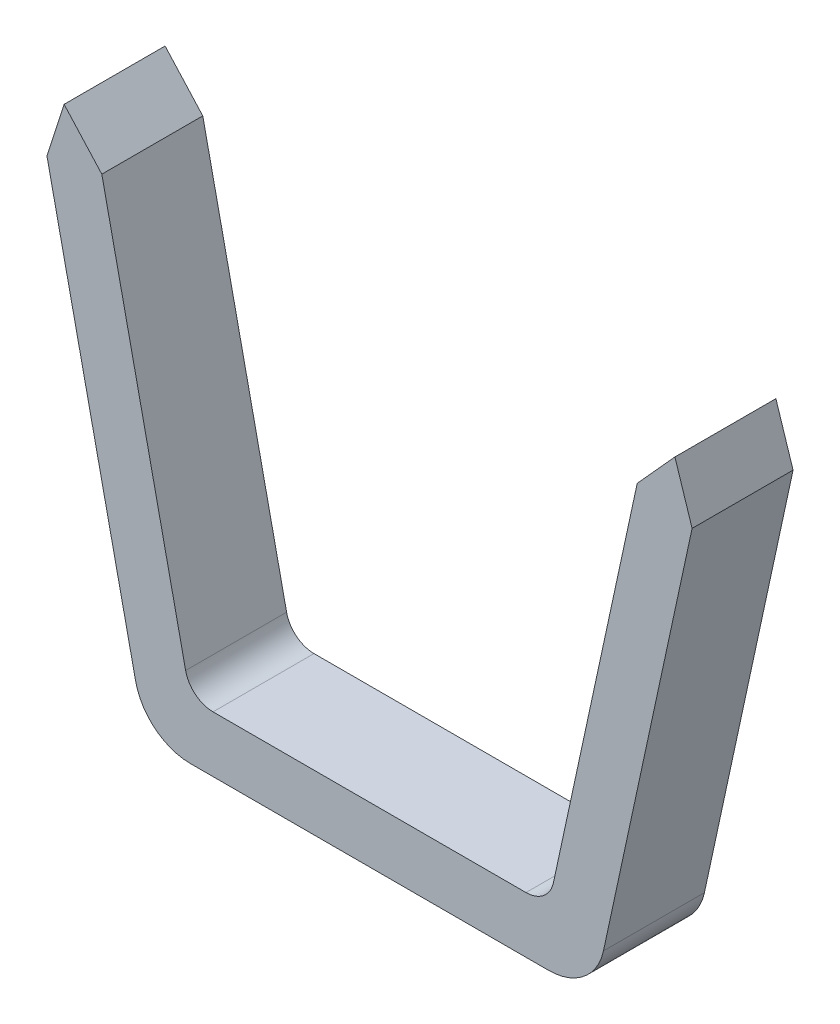
ISO-10303-21;
HEADER;
FILE_DESCRIPTION(('STEP AP214'),'2;1');
FILE_NAME('part.step','',(''),(''),'','','');
FILE_SCHEMA(('AUTOMOTIVE_DESIGN { 1 0 10303 214 1 1 1 1 }'));
ENDSEC;
DATA;
#1=APPLICATION_CONTEXT('core data for automotive mechanical design processes');
#2=APPLICATION_PROTOCOL_DEFINITION('international standard','automotive_design',2000,#1);
#3=PRODUCT_CONTEXT('',#1,'mechanical');
#4=PRODUCT('Part','Part','',(#3));
#5=PRODUCT_RELATED_PRODUCT_CATEGORY('part','',(#4));
#6=PRODUCT_DEFINITION_FORMATION('','',#4);
#7=PRODUCT_DEFINITION_CONTEXT('part definition',#1,'design');
#8=PRODUCT_DEFINITION('design','',#6,#7);
#9=PRODUCT_DEFINITION_SHAPE('','',#8);
#10=(LENGTH_UNIT() NAMED_UNIT(*) SI_UNIT(.MILLI.,.METRE.));
#11=(NAMED_UNIT(*) PLANE_ANGLE_UNIT() SI_UNIT($,.RADIAN.));
#12=(NAMED_UNIT(*) SI_UNIT($,.STERADIAN.) SOLID_ANGLE_UNIT());
#13=UNCERTAINTY_MEASURE_WITH_UNIT(LENGTH_MEASURE(1.E-05),#10,'distance_accuracy_value','');
#14=(GEOMETRIC_REPRESENTATION_CONTEXT(3) GLOBAL_UNCERTAINTY_ASSIGNED_CONTEXT((#13)) GLOBAL_UNIT_ASSIGNED_CONTEXT((#10,
#11,#12)) REPRESENTATION_CONTEXT('',''));
#15=CARTESIAN_POINT('',(0.,0.,0.));
#16=DIRECTION('',(0.,0.,1.));
#17=DIRECTION('',(1.,0.,0.));
#18=AXIS2_PLACEMENT_3D('',#15,#16,#17);
#19=CARTESIAN_POINT('',(-31.9298733487398,-112.5,18.));
#20=DIRECTION('',(0.,0.,1.));
#21=DIRECTION('',(1.,0.,0.));
#22=AXIS2_PLACEMENT_3D('',#19,#20,#21);
#23=PLANE('',#22);
#24=DIRECTION('',(0.306672532909785,-0.951815085801174,0.));
#25=VECTOR('',#24,1.);
#26=CARTESIAN_POINT('',(54.4443390688109,-31.9720104377862,18.));
#27=LINE('',#26,#25);
#28=CARTESIAN_POINT('',(54.4443390688109,-31.9720104377862,18.));
#29=VERTEX_POINT('',#28);
#30=CARTESIAN_POINT('',(57.5063561450649,-41.4755483598365,18.));
#31=VERTEX_POINT('',#30);
#32=EDGE_CURVE('E145',#29,#31,#27,.T.);
#33=ORIENTED_EDGE('',*,*,#32,.F.);
#34=DIRECTION('',(0.670959777554308,0.741493747043273,0.));
#35=VECTOR('',#34,1.);
#36=CARTESIAN_POINT('',(47.7244032118376,-39.3983727700264,18.));
#37=LINE('',#36,#35);
#38=CARTESIAN_POINT('',(47.7244032118376,-39.3983727700264,18.));
#39=VERTEX_POINT('',#38);
#40=EDGE_CURVE('E259',#39,#29,#37,.T.);
#41=ORIENTED_EDGE('',*,*,#40,.F.);
#42=DIRECTION('',(0.211189373172623,0.977445164016353,0.));
#43=VECTOR('',#42,1.);
#44=CARTESIAN_POINT('',(31.9298733487398,-112.5,18.));
#45=LINE('',#44,#43);
#46=CARTESIAN_POINT('',(32.7820358431914,-108.555946865863,18.));
#47=VERTEX_POINT('',#46);
#48=EDGE_CURVE('E219',#47,#39,#45,.T.);
#49=ORIENTED_EDGE('',*,*,#48,.F.);
#50=CARTESIAN_POINT('',(27.8948100231097,-107.5,18.));
#51=DIRECTION('',(0.,0.,1.));
#52=DIRECTION('',(1.,0.,0.));
#53=AXIS2_PLACEMENT_3D('',#50,#51,#52);
#54=CIRCLE('',#53,5.);
#55=CARTESIAN_POINT('',(27.8948100231097,-112.5,18.));
#56=VERTEX_POINT('',#55);
#57=EDGE_CURVE('E194',#47,#56,#54,.F.);
#58=ORIENTED_EDGE('',*,*,#57,.T.);
#59=DIRECTION('',(1.,0.,0.));
#60=VECTOR('',#59,1.);
#61=CARTESIAN_POINT('',(-31.9298733487398,-112.5,18.));
#62=LINE('',#61,#60);
#63=CARTESIAN_POINT('',(-27.8948100231097,-112.5,18.));
#64=VERTEX_POINT('',#63);
#65=EDGE_CURVE('E216',#64,#56,#62,.T.);
#66=ORIENTED_EDGE('',*,*,#65,.F.);
#67=CARTESIAN_POINT('',(-27.8948100231097,-107.5,18.));
#68=DIRECTION('',(0.,0.,1.));
#69=DIRECTION('',(1.,0.,0.));
#70=AXIS2_PLACEMENT_3D('',#67,#68,#69);
#71=CIRCLE('',#70,5.);
#72=CARTESIAN_POINT('',(-32.7820358431915,-108.555946865863,18.));
#73=VERTEX_POINT('',#72);
#74=EDGE_CURVE('E11',#64,#73,#71,.F.);
#75=ORIENTED_EDGE('',*,*,#74,.T.);
#76=DIRECTION('',(0.211189373172623,-0.977445164016353,0.));
#77=VECTOR('',#76,1.);
#78=CARTESIAN_POINT('',(-31.9298733487398,-112.5,18.));
#79=LINE('',#78,#77);
#80=CARTESIAN_POINT('',(-47.7236876934698,-39.4016843948391,18.));
#81=VERTEX_POINT('',#80);
#82=EDGE_CURVE('E215',#81,#73,#79,.T.);
#83=ORIENTED_EDGE('',*,*,#82,.F.);
#84=DIRECTION('',(0.67089697040122,-0.741550574881083,0.));
#85=VECTOR('',#84,1.);
#86=CARTESIAN_POINT('',(-54.4439824625953,-31.9736609139237,18.));
#87=LINE('',#86,#85);
#88=CARTESIAN_POINT('',(-54.4439824625953,-31.9736609139237,18.));
#89=VERTEX_POINT('',#88);
#90=EDGE_CURVE('E48',#89,#81,#87,.T.);
#91=ORIENTED_EDGE('',*,*,#90,.F.);
#92=DIRECTION('',(0.306753150837407,0.95178910713,0.));
#93=VECTOR('',#92,1.);
#94=CARTESIAN_POINT('',(-57.5063561450649,-41.4755483598365,18.));
#95=LINE('',#94,#93);
#96=CARTESIAN_POINT('',(-57.5063561450649,-41.4755483598365,18.));
#97=VERTEX_POINT('',#96);
#98=EDGE_CURVE('E256',#97,#89,#95,.T.);
#99=ORIENTED_EDGE('',*,*,#98,.F.);
#100=DIRECTION('',(0.211189373172623,-0.977445164016353,0.));
#101=VECTOR('',#100,1.);
#102=CARTESIAN_POINT('',(-73.3083873012264,31.6607970120533,18.));
#103=LINE('',#102,#101);
#104=CARTESIAN_POINT('',(-41.7043249889033,-114.611893731726,18.));
#105=VERTEX_POINT('',#104);
#106=EDGE_CURVE('E153',#97,#105,#103,.T.);
#107=ORIENTED_EDGE('',*,*,#106,.T.);
#108=CARTESIAN_POINT('',(-31.9298733487398,-112.5,18.));
#109=DIRECTION('',(0.,0.,1.));
#110=DIRECTION('',(1.,0.,0.));
#111=AXIS2_PLACEMENT_3D('',#108,#109,#110);
#112=CIRCLE('',#111,10.);
#113=CARTESIAN_POINT('',(-31.9298733487398,-122.5,18.));
#114=VERTEX_POINT('',#113);
#115=EDGE_CURVE('E160',#105,#114,#112,.T.);
#116=ORIENTED_EDGE('',*,*,#115,.T.);
#117=DIRECTION('',(1.,0.,0.));
#118=VECTOR('',#117,1.);
#119=CARTESIAN_POINT('',(-31.9298733487398,-122.5,18.));
#120=LINE('',#119,#118);
#121=CARTESIAN_POINT('',(31.9298733487398,-122.5,18.));
#122=VERTEX_POINT('',#121);
#123=EDGE_CURVE('E164',#114,#122,#120,.T.);
#124=ORIENTED_EDGE('',*,*,#123,.T.);
#125=CARTESIAN_POINT('',(31.9298733487398,-112.5,18.));
#126=DIRECTION('',(0.,0.,1.));
#127=DIRECTION('',(1.,0.,0.));
#128=AXIS2_PLACEMENT_3D('',#125,#126,#127);
#129=CIRCLE('',#128,10.);
#130=CARTESIAN_POINT('',(41.7043249889033,-114.611893731726,18.));
#131=VERTEX_POINT('',#130);
#132=EDGE_CURVE('E230',#122,#131,#129,.T.);
#133=ORIENTED_EDGE('',*,*,#132,.T.);
#134=DIRECTION('',(0.211189373172623,0.977445164016353,0.));
#135=VECTOR('',#134,1.);
#136=CARTESIAN_POINT('',(41.7043249889033,-114.611893731726,18.));
#137=LINE('',#136,#135);
#138=EDGE_CURVE('E232',#131,#31,#137,.T.);
#139=ORIENTED_EDGE('',*,*,#138,.T.);
#140=EDGE_LOOP('',(#33,#41,#49,#58,#66,#75,#83,#91,#99,#107,#116,#124,#133,#139));
#141=FACE_BOUND('',#140,.T.);
#142=ADVANCED_FACE('F33',(#141),#23,.T.);
#143=CARTESIAN_POINT('',(-31.9298733487398,-112.5,0.));
#144=DIRECTION('',(0.,0.,1.));
#145=DIRECTION('',(1.,0.,0.));
#146=AXIS2_PLACEMENT_3D('',#143,#144,#145);
#147=PLANE('',#146);
#148=DIRECTION('',(0.670959777554308,0.741493747043273,0.));
#149=VECTOR('',#148,1.);
#150=CARTESIAN_POINT('',(47.7244032118376,-39.3983727700264,0.));
#151=LINE('',#150,#149);
#152=CARTESIAN_POINT('',(47.7244032118376,-39.3983727700264,0.));
#153=VERTEX_POINT('',#152);
#154=CARTESIAN_POINT('',(54.4443390688109,-31.9720104377862,0.));
#155=VERTEX_POINT('',#154);
#156=EDGE_CURVE('E56',#153,#155,#151,.T.);
#157=ORIENTED_EDGE('',*,*,#156,.T.);
#158=DIRECTION('',(0.306672532909785,-0.951815085801174,0.));
#159=VECTOR('',#158,1.);
#160=CARTESIAN_POINT('',(54.4443390688109,-31.9720104377862,0.));
#161=LINE('',#160,#159);
#162=CARTESIAN_POINT('',(57.5063561450649,-41.4755483598365,0.));
#163=VERTEX_POINT('',#162);
#164=EDGE_CURVE('E154',#155,#163,#161,.T.);
#165=ORIENTED_EDGE('',*,*,#164,.T.);
#166=DIRECTION('',(0.211189373172623,0.977445164016353,0.));
#167=VECTOR('',#166,1.);
#168=CARTESIAN_POINT('',(41.7043249889033,-114.611893731726,0.));
#169=LINE('',#168,#167);
#170=CARTESIAN_POINT('',(41.7043249889033,-114.611893731726,0.));
#171=VERTEX_POINT('',#170);
#172=EDGE_CURVE('E161',#171,#163,#169,.T.);
#173=ORIENTED_EDGE('',*,*,#172,.F.);
#174=CARTESIAN_POINT('',(31.9298733487398,-112.5,0.));
#175=DIRECTION('',(0.,0.,1.));
#176=DIRECTION('',(1.,0.,0.));
#177=AXIS2_PLACEMENT_3D('',#174,#175,#176);
#178=CIRCLE('',#177,10.);
#179=CARTESIAN_POINT('',(31.9298733487398,-122.5,0.));
#180=VERTEX_POINT('',#179);
#181=EDGE_CURVE('E167',#180,#171,#178,.T.);
#182=ORIENTED_EDGE('',*,*,#181,.F.);
#183=DIRECTION('',(1.,0.,0.));
#184=VECTOR('',#183,1.);
#185=CARTESIAN_POINT('',(-31.9298733487398,-122.5,0.));
#186=LINE('',#185,#184);
#187=CARTESIAN_POINT('',(-31.9298733487398,-122.5,0.));
#188=VERTEX_POINT('',#187);
#189=EDGE_CURVE('E237',#188,#180,#186,.T.);
#190=ORIENTED_EDGE('',*,*,#189,.F.);
#191=CARTESIAN_POINT('',(-31.9298733487398,-112.5,0.));
#192=DIRECTION('',(0.,0.,1.));
#193=DIRECTION('',(1.,0.,0.));
#194=AXIS2_PLACEMENT_3D('',#191,#192,#193);
#195=CIRCLE('',#194,10.);
#196=CARTESIAN_POINT('',(-41.7043249889033,-114.611893731726,0.));
#197=VERTEX_POINT('',#196);
#198=EDGE_CURVE('E159',#197,#188,#195,.T.);
#199=ORIENTED_EDGE('',*,*,#198,.F.);
#200=DIRECTION('',(0.211189373172623,-0.977445164016353,0.));
#201=VECTOR('',#200,1.);
#202=CARTESIAN_POINT('',(-73.3083873012264,31.6607970120533,0.));
#203=LINE('',#202,#201);
#204=CARTESIAN_POINT('',(-57.5063561450649,-41.4755483598365,0.));
#205=VERTEX_POINT('',#204);
#206=EDGE_CURVE('E151',#205,#197,#203,.T.);
#207=ORIENTED_EDGE('',*,*,#206,.F.);
#208=DIRECTION('',(0.306753150837407,0.95178910713,0.));
#209=VECTOR('',#208,1.);
#210=CARTESIAN_POINT('',(-57.5063561450649,-41.4755483598365,0.));
#211=LINE('',#210,#209);
#212=CARTESIAN_POINT('',(-54.4439824625953,-31.9736609139237,0.));
#213=VERTEX_POINT('',#212);
#214=EDGE_CURVE('E133',#205,#213,#211,.T.);
#215=ORIENTED_EDGE('',*,*,#214,.T.);
#216=DIRECTION('',(0.67089697040122,-0.741550574881083,0.));
#217=VECTOR('',#216,1.);
#218=CARTESIAN_POINT('',(-54.4439824625953,-31.9736609139237,0.));
#219=LINE('',#218,#217);
#220=CARTESIAN_POINT('',(-47.7236876934698,-39.4016843948391,0.));
#221=VERTEX_POINT('',#220);
#222=EDGE_CURVE('E144',#213,#221,#219,.T.);
#223=ORIENTED_EDGE('',*,*,#222,.T.);
#224=DIRECTION('',(0.211189373172623,-0.977445164016353,0.));
#225=VECTOR('',#224,1.);
#226=CARTESIAN_POINT('',(-31.9298733487398,-112.5,0.));
#227=LINE('',#226,#225);
#228=CARTESIAN_POINT('',(-32.7820358431915,-108.555946865863,0.));
#229=VERTEX_POINT('',#228);
#230=EDGE_CURVE('E200',#221,#229,#227,.T.);
#231=ORIENTED_EDGE('',*,*,#230,.T.);
#232=CARTESIAN_POINT('',(-27.8948100231097,-107.5,0.));
#233=DIRECTION('',(0.,0.,1.));
#234=DIRECTION('',(1.,0.,0.));
#235=AXIS2_PLACEMENT_3D('',#232,#233,#234);
#236=CIRCLE('',#235,5.);
#237=CARTESIAN_POINT('',(-27.8948100231097,-112.5,0.));
#238=VERTEX_POINT('',#237);
#239=EDGE_CURVE('E41',#229,#238,#236,.T.);
#240=ORIENTED_EDGE('',*,*,#239,.T.);
#241=DIRECTION('',(1.,0.,0.));
#242=VECTOR('',#241,1.);
#243=CARTESIAN_POINT('',(-31.9298733487398,-112.5,0.));
#244=LINE('',#243,#242);
#245=CARTESIAN_POINT('',(27.8948100231097,-112.5,0.));
#246=VERTEX_POINT('',#245);
#247=EDGE_CURVE('E198',#238,#246,#244,.T.);
#248=ORIENTED_EDGE('',*,*,#247,.T.);
#249=CARTESIAN_POINT('',(27.8948100231097,-107.5,0.));
#250=DIRECTION('',(0.,0.,1.));
#251=DIRECTION('',(1.,0.,0.));
#252=AXIS2_PLACEMENT_3D('',#249,#250,#251);
#253=CIRCLE('',#252,5.);
#254=CARTESIAN_POINT('',(32.7820358431914,-108.555946865863,0.));
#255=VERTEX_POINT('',#254);
#256=EDGE_CURVE('E192',#246,#255,#253,.T.);
#257=ORIENTED_EDGE('',*,*,#256,.T.);
#258=DIRECTION('',(0.211189373172623,0.977445164016353,0.));
#259=VECTOR('',#258,1.);
#260=CARTESIAN_POINT('',(31.9298733487398,-112.5,0.));
#261=LINE('',#260,#259);
#262=EDGE_CURVE('E209',#255,#153,#261,.T.);
#263=ORIENTED_EDGE('',*,*,#262,.T.);
#264=EDGE_LOOP('',(#157,#165,#173,#182,#190,#199,#207,#215,#223,#231,#240,#248,#257,#263));
#265=FACE_BOUND('',#264,.T.);
#266=ADVANCED_FACE('F157',(#265),#147,.F.);
#267=CARTESIAN_POINT('',(-31.9298733487398,-112.5,18.));
#268=DIRECTION('',(0.,0.,-1.));
#269=DIRECTION('',(-1.,0.,0.));
#270=AXIS2_PLACEMENT_3D('',#267,#268,#269);
#271=CYLINDRICAL_SURFACE('',#270,10.);
#272=ORIENTED_EDGE('',*,*,#198,.T.);
#273=DIRECTION('',(0.,0.,-1.));
#274=VECTOR('',#273,1.);
#275=CARTESIAN_POINT('',(-31.9298733487398,-122.5,18.));
#276=LINE('',#275,#274);
#277=EDGE_CURVE('E179',#114,#188,#276,.T.);
#278=ORIENTED_EDGE('',*,*,#277,.F.);
#279=ORIENTED_EDGE('',*,*,#115,.F.);
#280=DIRECTION('',(0.,0.,-1.));
#281=VECTOR('',#280,1.);
#282=CARTESIAN_POINT('',(-41.7043249889033,-114.611893731726,18.));
#283=LINE('',#282,#281);
#284=EDGE_CURVE('E171',#105,#197,#283,.T.);
#285=ORIENTED_EDGE('',*,*,#284,.T.);
#286=EDGE_LOOP('',(#272,#278,#279,#285));
#287=FACE_BOUND('',#286,.T.);
#288=ADVANCED_FACE('F274',(#287),#271,.T.);
#289=CARTESIAN_POINT('',(-31.9298733487398,-122.5,18.));
#290=DIRECTION('',(0.,1.,0.));
#291=DIRECTION('',(0.,0.,1.));
#292=AXIS2_PLACEMENT_3D('',#289,#290,#291);
#293=PLANE('',#292);
#294=ORIENTED_EDGE('',*,*,#189,.T.);
#295=DIRECTION('',(0.,0.,-1.));
#296=VECTOR('',#295,1.);
#297=CARTESIAN_POINT('',(31.9298733487398,-122.5,18.));
#298=LINE('',#297,#296);
#299=EDGE_CURVE('E176',#122,#180,#298,.T.);
#300=ORIENTED_EDGE('',*,*,#299,.F.);
#301=ORIENTED_EDGE('',*,*,#123,.F.);
#302=ORIENTED_EDGE('',*,*,#277,.T.);
#303=EDGE_LOOP('',(#294,#300,#301,#302));
#304=FACE_BOUND('',#303,.T.);
#305=ADVANCED_FACE('F276',(#304),#293,.F.);
#306=CARTESIAN_POINT('',(31.9298733487398,-112.5,18.));
#307=DIRECTION('',(0.,0.,-1.));
#308=DIRECTION('',(-1.,0.,0.));
#309=AXIS2_PLACEMENT_3D('',#306,#307,#308);
#310=CYLINDRICAL_SURFACE('',#309,10.);
#311=ORIENTED_EDGE('',*,*,#181,.T.);
#312=DIRECTION('',(0.,0.,-1.));
#313=VECTOR('',#312,1.);
#314=CARTESIAN_POINT('',(41.7043249889033,-114.611893731726,18.));
#315=LINE('',#314,#313);
#316=EDGE_CURVE('E173',#131,#171,#315,.T.);
#317=ORIENTED_EDGE('',*,*,#316,.F.);
#318=ORIENTED_EDGE('',*,*,#132,.F.);
#319=ORIENTED_EDGE('',*,*,#299,.T.);
#320=EDGE_LOOP('',(#311,#317,#318,#319));
#321=FACE_BOUND('',#320,.T.);
#322=ADVANCED_FACE('F241',(#321),#310,.T.);
#323=CARTESIAN_POINT('',(41.7043249889033,-114.611893731726,18.));
#324=DIRECTION('',(-0.977445164016353,0.211189373172623,0.));
#325=DIRECTION('',(-0.211189373172623,-0.977445164016353,0.));
#326=AXIS2_PLACEMENT_3D('',#323,#324,#325);
#327=PLANE('',#326);
#328=ORIENTED_EDGE('',*,*,#172,.T.);
#329=DIRECTION('',(0.,0.,1.));
#330=VECTOR('',#329,1.);
#331=CARTESIAN_POINT('',(57.5063561450649,-41.4755483598365,0.));
#332=LINE('',#331,#330);
#333=EDGE_CURVE('E225',#163,#31,#332,.T.);
#334=ORIENTED_EDGE('',*,*,#333,.T.);
#335=ORIENTED_EDGE('',*,*,#138,.F.);
#336=ORIENTED_EDGE('',*,*,#316,.T.);
#337=EDGE_LOOP('',(#328,#334,#335,#336));
#338=FACE_BOUND('',#337,.T.);
#339=ADVANCED_FACE('F247',(#338),#327,.F.);
#340=CARTESIAN_POINT('',(-73.3083873012264,31.6607970120533,18.));
#341=DIRECTION('',(0.977445164016353,0.211189373172623,0.));
#342=DIRECTION('',(-0.211189373172623,0.977445164016353,0.));
#343=AXIS2_PLACEMENT_3D('',#340,#341,#342);
#344=PLANE('',#343);
#345=ORIENTED_EDGE('',*,*,#106,.F.);
#346=DIRECTION('',(0.,0.,1.));
#347=VECTOR('',#346,1.);
#348=CARTESIAN_POINT('',(-57.5063561450649,-41.4755483598365,0.));
#349=LINE('',#348,#347);
#350=EDGE_CURVE('E137',#205,#97,#349,.T.);
#351=ORIENTED_EDGE('',*,*,#350,.F.);
#352=ORIENTED_EDGE('',*,*,#206,.T.);
#353=ORIENTED_EDGE('',*,*,#284,.F.);
#354=EDGE_LOOP('',(#345,#351,#352,#353));
#355=FACE_BOUND('',#354,.T.);
#356=ADVANCED_FACE('F149',(#355),#344,.F.);
#357=CARTESIAN_POINT('',(-31.9298733487398,-112.5,18.));
#358=DIRECTION('',(0.977445164016353,0.211189373172623,0.));
#359=DIRECTION('',(-0.211189373172623,0.977445164016353,0.));
#360=AXIS2_PLACEMENT_3D('',#357,#358,#359);
#361=PLANE('',#360);
#362=DIRECTION('',(0.,0.,1.));
#363=VECTOR('',#362,1.);
#364=CARTESIAN_POINT('',(-47.7236876934698,-39.4016843948391,0.));
#365=LINE('',#364,#363);
#366=EDGE_CURVE('E268',#221,#81,#365,.T.);
#367=ORIENTED_EDGE('',*,*,#366,.T.);
#368=ORIENTED_EDGE('',*,*,#82,.T.);
#369=DIRECTION('',(0.,0.,-1.));
#370=VECTOR('',#369,1.);
#371=CARTESIAN_POINT('',(-32.7820358431915,-108.555946865863,0.));
#372=LINE('',#371,#370);
#373=EDGE_CURVE('E189',#73,#229,#372,.T.);
#374=ORIENTED_EDGE('',*,*,#373,.T.);
#375=ORIENTED_EDGE('',*,*,#230,.F.);
#376=EDGE_LOOP('',(#367,#368,#374,#375));
#377=FACE_BOUND('',#376,.T.);
#378=ADVANCED_FACE('F300',(#377),#361,.T.);
#379=CARTESIAN_POINT('',(-31.9298733487398,-112.5,18.));
#380=DIRECTION('',(0.,1.,0.));
#381=DIRECTION('',(0.,0.,1.));
#382=AXIS2_PLACEMENT_3D('',#379,#380,#381);
#383=PLANE('',#382);
#384=ORIENTED_EDGE('',*,*,#65,.T.);
#385=DIRECTION('',(0.,0.,-1.));
#386=VECTOR('',#385,1.);
#387=CARTESIAN_POINT('',(27.8948100231097,-112.5,0.));
#388=LINE('',#387,#386);
#389=EDGE_CURVE('E184',#56,#246,#388,.T.);
#390=ORIENTED_EDGE('',*,*,#389,.T.);
#391=ORIENTED_EDGE('',*,*,#247,.F.);
#392=DIRECTION('',(0.,0.,-1.));
#393=VECTOR('',#392,1.);
#394=CARTESIAN_POINT('',(-27.8948100231097,-112.5,18.));
#395=LINE('',#394,#393);
#396=EDGE_CURVE('E182',#238,#64,#395,.F.);
#397=ORIENTED_EDGE('',*,*,#396,.T.);
#398=EDGE_LOOP('',(#384,#390,#391,#397));
#399=FACE_BOUND('',#398,.T.);
#400=ADVANCED_FACE('F206',(#399),#383,.T.);
#401=CARTESIAN_POINT('',(31.9298733487398,-112.5,18.));
#402=DIRECTION('',(-0.977445164016353,0.211189373172623,0.));
#403=DIRECTION('',(-0.211189373172623,-0.977445164016353,0.));
#404=AXIS2_PLACEMENT_3D('',#401,#402,#403);
#405=PLANE('',#404);
#406=DIRECTION('',(0.,0.,1.));
#407=VECTOR('',#406,1.);
#408=CARTESIAN_POINT('',(47.7244032118376,-39.3983727700264,0.));
#409=LINE('',#408,#407);
#410=EDGE_CURVE('E266',#153,#39,#409,.T.);
#411=ORIENTED_EDGE('',*,*,#410,.F.);
#412=ORIENTED_EDGE('',*,*,#262,.F.);
#413=DIRECTION('',(0.,0.,-1.));
#414=VECTOR('',#413,1.);
#415=CARTESIAN_POINT('',(32.7820358431914,-108.555946865863,18.));
#416=LINE('',#415,#414);
#417=EDGE_CURVE('E187',#255,#47,#416,.F.);
#418=ORIENTED_EDGE('',*,*,#417,.T.);
#419=ORIENTED_EDGE('',*,*,#48,.T.);
#420=EDGE_LOOP('',(#411,#412,#418,#419));
#421=FACE_BOUND('',#420,.T.);
#422=ADVANCED_FACE('F282',(#421),#405,.T.);
#423=CARTESIAN_POINT('',(27.8948100231097,-107.5,18.));
#424=DIRECTION('',(0.,0.,1.));
#425=DIRECTION('',(1.,0.,0.));
#426=AXIS2_PLACEMENT_3D('',#423,#424,#425);
#427=CYLINDRICAL_SURFACE('',#426,5.);
#428=ORIENTED_EDGE('',*,*,#57,.F.);
#429=ORIENTED_EDGE('',*,*,#417,.F.);
#430=ORIENTED_EDGE('',*,*,#256,.F.);
#431=ORIENTED_EDGE('',*,*,#389,.F.);
#432=EDGE_LOOP('',(#428,#429,#430,#431));
#433=FACE_BOUND('',#432,.T.);
#434=ADVANCED_FACE('F285',(#433),#427,.F.);
#435=CARTESIAN_POINT('',(-27.8948100231097,-107.5,18.));
#436=DIRECTION('',(0.,0.,1.));
#437=DIRECTION('',(1.,0.,0.));
#438=AXIS2_PLACEMENT_3D('',#435,#436,#437);
#439=CYLINDRICAL_SURFACE('',#438,5.);
#440=ORIENTED_EDGE('',*,*,#74,.F.);
#441=ORIENTED_EDGE('',*,*,#396,.F.);
#442=ORIENTED_EDGE('',*,*,#239,.F.);
#443=ORIENTED_EDGE('',*,*,#373,.F.);
#444=EDGE_LOOP('',(#440,#441,#442,#443));
#445=FACE_BOUND('',#444,.T.);
#446=ADVANCED_FACE('F35',(#445),#439,.F.);
#447=CARTESIAN_POINT('',(47.7244032118376,-39.3983727700264,0.));
#448=DIRECTION('',(0.741493747043273,-0.670959777554308,0.));
#449=DIRECTION('',(0.670959777554308,0.741493747043273,0.));
#450=AXIS2_PLACEMENT_3D('',#447,#448,#449);
#451=PLANE('',#450);
#452=ORIENTED_EDGE('',*,*,#40,.T.);
#453=DIRECTION('',(0.,0.,1.));
#454=VECTOR('',#453,1.);
#455=CARTESIAN_POINT('',(54.4443390688109,-31.9720104377862,0.));
#456=LINE('',#455,#454);
#457=EDGE_CURVE('E264',#155,#29,#456,.T.);
#458=ORIENTED_EDGE('',*,*,#457,.F.);
#459=ORIENTED_EDGE('',*,*,#156,.F.);
#460=ORIENTED_EDGE('',*,*,#410,.T.);
#461=EDGE_LOOP('',(#452,#458,#459,#460));
#462=FACE_BOUND('',#461,.T.);
#463=ADVANCED_FACE('F279',(#462),#451,.F.);
#464=CARTESIAN_POINT('',(54.4443390688109,-31.9720104377862,0.));
#465=DIRECTION('',(-0.951815085801174,-0.306672532909785,0.));
#466=DIRECTION('',(0.306672532909785,-0.951815085801174,0.));
#467=AXIS2_PLACEMENT_3D('',#464,#465,#466);
#468=PLANE('',#467);
#469=ORIENTED_EDGE('',*,*,#32,.T.);
#470=ORIENTED_EDGE('',*,*,#333,.F.);
#471=ORIENTED_EDGE('',*,*,#164,.F.);
#472=ORIENTED_EDGE('',*,*,#457,.T.);
#473=EDGE_LOOP('',(#469,#470,#471,#472));
#474=FACE_BOUND('',#473,.T.);
#475=ADVANCED_FACE('F278',(#474),#468,.F.);
#476=CARTESIAN_POINT('',(-54.4439824625953,-31.9736609139237,0.));
#477=DIRECTION('',(-0.741550574881083,-0.670896970401219,0.));
#478=DIRECTION('',(0.67089697040122,-0.741550574881083,0.));
#479=AXIS2_PLACEMENT_3D('',#476,#477,#478);
#480=PLANE('',#479);
#481=ORIENTED_EDGE('',*,*,#90,.T.);
#482=ORIENTED_EDGE('',*,*,#366,.F.);
#483=ORIENTED_EDGE('',*,*,#222,.F.);
#484=DIRECTION('',(0.,0.,1.));
#485=VECTOR('',#484,1.);
#486=CARTESIAN_POINT('',(-54.4439824625953,-31.9736609139237,0.));
#487=LINE('',#486,#485);
#488=EDGE_CURVE('E139',#213,#89,#487,.T.);
#489=ORIENTED_EDGE('',*,*,#488,.T.);
#490=EDGE_LOOP('',(#481,#482,#483,#489));
#491=FACE_BOUND('',#490,.T.);
#492=ADVANCED_FACE('F270',(#491),#480,.F.);
#493=CARTESIAN_POINT('',(-57.5063561450649,-41.4755483598365,0.));
#494=DIRECTION('',(0.95178910713,-0.306753150837407,0.));
#495=DIRECTION('',(0.306753150837407,0.95178910713,0.));
#496=AXIS2_PLACEMENT_3D('',#493,#494,#495);
#497=PLANE('',#496);
#498=ORIENTED_EDGE('',*,*,#98,.T.);
#499=ORIENTED_EDGE('',*,*,#488,.F.);
#500=ORIENTED_EDGE('',*,*,#214,.F.);
#501=ORIENTED_EDGE('',*,*,#350,.T.);
#502=EDGE_LOOP('',(#498,#499,#500,#501));
#503=FACE_BOUND('',#502,.T.);
#504=ADVANCED_FACE('F136',(#503),#497,.F.);
#505=CLOSED_SHELL('',(#142,#266,#288,#305,#322,#339,#356,#378,#400,#422,#434,#446,#463,#475,
#492,#504));
#506=MANIFOLD_SOLID_BREP('B2',#505);
#507=ADVANCED_BREP_SHAPE_REPRESENTATION('',(#18,#506),#14);
#508=SHAPE_DEFINITION_REPRESENTATION(#9,#507);
ENDSEC;
END-ISO-10303-21;
